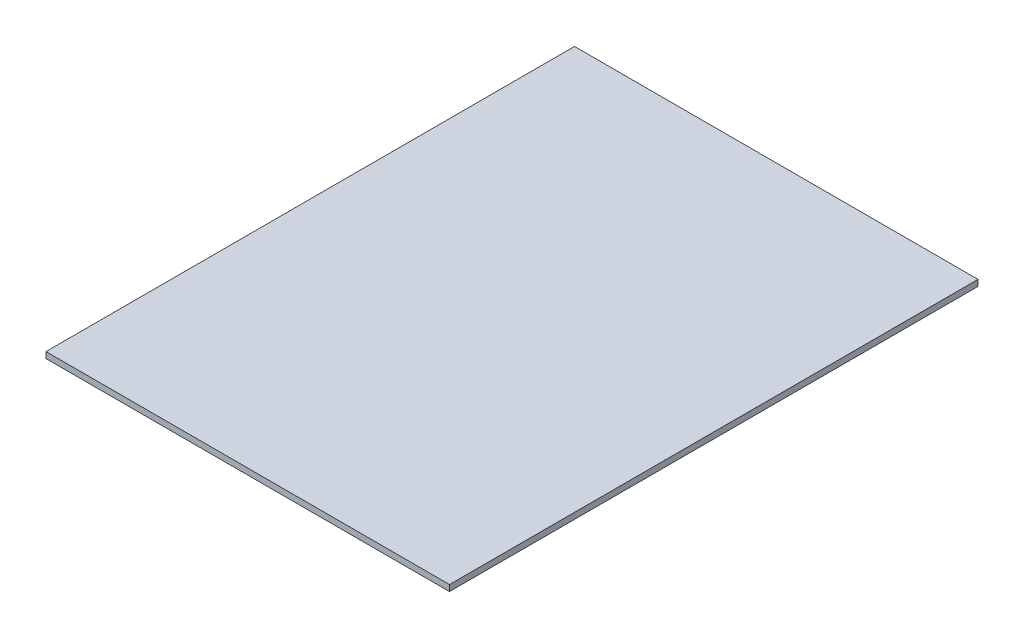
ISO-10303-21;
HEADER;
FILE_DESCRIPTION(('STEP AP214'),'2;1');
FILE_NAME('part.step','',(''),(''),'','','');
FILE_SCHEMA(('AUTOMOTIVE_DESIGN { 1 0 10303 214 1 1 1 1 }'));
ENDSEC;
DATA;
#1=APPLICATION_CONTEXT('core data for automotive mechanical design processes');
#2=APPLICATION_PROTOCOL_DEFINITION('international standard','automotive_design',2000,#1);
#3=PRODUCT_CONTEXT('',#1,'mechanical');
#4=PRODUCT('Part','Part','',(#3));
#5=PRODUCT_RELATED_PRODUCT_CATEGORY('part','',(#4));
#6=PRODUCT_DEFINITION_FORMATION('','',#4);
#7=PRODUCT_DEFINITION_CONTEXT('part definition',#1,'design');
#8=PRODUCT_DEFINITION('design','',#6,#7);
#9=PRODUCT_DEFINITION_SHAPE('','',#8);
#10=(LENGTH_UNIT() NAMED_UNIT(*) SI_UNIT(.MILLI.,.METRE.));
#11=(NAMED_UNIT(*) PLANE_ANGLE_UNIT() SI_UNIT($,.RADIAN.));
#12=(NAMED_UNIT(*) SI_UNIT($,.STERADIAN.) SOLID_ANGLE_UNIT());
#13=UNCERTAINTY_MEASURE_WITH_UNIT(LENGTH_MEASURE(1.E-05),#10,'distance_accuracy_value','');
#14=(GEOMETRIC_REPRESENTATION_CONTEXT(3) GLOBAL_UNCERTAINTY_ASSIGNED_CONTEXT((#13)) GLOBAL_UNIT_ASSIGNED_CONTEXT((#10,
#11,#12)) REPRESENTATION_CONTEXT('',''));
#15=CARTESIAN_POINT('',(0.,0.,0.));
#16=DIRECTION('',(0.,0.,1.));
#17=DIRECTION('',(1.,0.,0.));
#18=AXIS2_PLACEMENT_3D('',#15,#16,#17);
#19=CARTESIAN_POINT('',(-198.5,6.,260.));
#20=DIRECTION('',(1.,0.,0.));
#21=DIRECTION('',(0.,0.,-1.));
#22=AXIS2_PLACEMENT_3D('',#19,#20,#21);
#23=PLANE('',#22);
#24=DIRECTION('',(0.,0.,1.));
#25=VECTOR('',#24,1.);
#26=CARTESIAN_POINT('',(-198.5,0.,260.));
#27=LINE('',#26,#25);
#28=CARTESIAN_POINT('',(-198.5,0.,-260.));
#29=VERTEX_POINT('',#28);
#30=CARTESIAN_POINT('',(-198.5,0.,260.));
#31=VERTEX_POINT('',#30);
#32=EDGE_CURVE('E95',#29,#31,#27,.T.);
#33=ORIENTED_EDGE('',*,*,#32,.T.);
#34=DIRECTION('',(0.,-1.,0.));
#35=VECTOR('',#34,1.);
#36=CARTESIAN_POINT('',(-198.5,6.,260.));
#37=LINE('',#36,#35);
#38=CARTESIAN_POINT('',(-198.5,6.,260.));
#39=VERTEX_POINT('',#38);
#40=EDGE_CURVE('E11',#39,#31,#37,.T.);
#41=ORIENTED_EDGE('',*,*,#40,.F.);
#42=DIRECTION('',(0.,0.,1.));
#43=VECTOR('',#42,1.);
#44=CARTESIAN_POINT('',(-198.5,6.,260.));
#45=LINE('',#44,#43);
#46=CARTESIAN_POINT('',(-198.5,6.,-260.));
#47=VERTEX_POINT('',#46);
#48=EDGE_CURVE('E83',#47,#39,#45,.T.);
#49=ORIENTED_EDGE('',*,*,#48,.F.);
#50=DIRECTION('',(0.,-1.,0.));
#51=VECTOR('',#50,1.);
#52=CARTESIAN_POINT('',(-198.5,6.,-260.));
#53=LINE('',#52,#51);
#54=EDGE_CURVE('E91',#47,#29,#53,.T.);
#55=ORIENTED_EDGE('',*,*,#54,.T.);
#56=EDGE_LOOP('',(#33,#41,#49,#55));
#57=FACE_BOUND('',#56,.T.);
#58=ADVANCED_FACE('F32',(#57),#23,.F.);
#59=CARTESIAN_POINT('',(198.5,6.,260.));
#60=DIRECTION('',(0.,0.,-1.));
#61=DIRECTION('',(-1.,0.,0.));
#62=AXIS2_PLACEMENT_3D('',#59,#60,#61);
#63=PLANE('',#62);
#64=DIRECTION('',(1.,0.,0.));
#65=VECTOR('',#64,1.);
#66=CARTESIAN_POINT('',(198.5,0.,260.));
#67=LINE('',#66,#65);
#68=CARTESIAN_POINT('',(198.5,0.,260.));
#69=VERTEX_POINT('',#68);
#70=EDGE_CURVE('E87',#31,#69,#67,.T.);
#71=ORIENTED_EDGE('',*,*,#70,.T.);
#72=DIRECTION('',(0.,-1.,0.));
#73=VECTOR('',#72,1.);
#74=CARTESIAN_POINT('',(198.5,6.,260.));
#75=LINE('',#74,#73);
#76=CARTESIAN_POINT('',(198.5,6.,260.));
#77=VERTEX_POINT('',#76);
#78=EDGE_CURVE('E40',#77,#69,#75,.T.);
#79=ORIENTED_EDGE('',*,*,#78,.F.);
#80=DIRECTION('',(1.,0.,0.));
#81=VECTOR('',#80,1.);
#82=CARTESIAN_POINT('',(198.5,6.,260.));
#83=LINE('',#82,#81);
#84=EDGE_CURVE('E78',#39,#77,#83,.T.);
#85=ORIENTED_EDGE('',*,*,#84,.F.);
#86=ORIENTED_EDGE('',*,*,#40,.T.);
#87=EDGE_LOOP('',(#71,#79,#85,#86));
#88=FACE_BOUND('',#87,.T.);
#89=ADVANCED_FACE('F86',(#88),#63,.F.);
#90=CARTESIAN_POINT('',(198.5,6.,260.));
#91=DIRECTION('',(-1.,0.,0.));
#92=DIRECTION('',(0.,0.,1.));
#93=AXIS2_PLACEMENT_3D('',#90,#91,#92);
#94=PLANE('',#93);
#95=DIRECTION('',(0.,0.,-1.));
#96=VECTOR('',#95,1.);
#97=CARTESIAN_POINT('',(198.5,0.,260.));
#98=LINE('',#97,#96);
#99=CARTESIAN_POINT('',(198.5,0.,-260.));
#100=VERTEX_POINT('',#99);
#101=EDGE_CURVE('E65',#69,#100,#98,.T.);
#102=ORIENTED_EDGE('',*,*,#101,.T.);
#103=DIRECTION('',(0.,-1.,0.));
#104=VECTOR('',#103,1.);
#105=CARTESIAN_POINT('',(198.5,6.,-260.));
#106=LINE('',#105,#104);
#107=CARTESIAN_POINT('',(198.5,6.,-260.));
#108=VERTEX_POINT('',#107);
#109=EDGE_CURVE('E88',#108,#100,#106,.T.);
#110=ORIENTED_EDGE('',*,*,#109,.F.);
#111=DIRECTION('',(0.,0.,-1.));
#112=VECTOR('',#111,1.);
#113=CARTESIAN_POINT('',(198.5,6.,260.));
#114=LINE('',#113,#112);
#115=EDGE_CURVE('E81',#77,#108,#114,.T.);
#116=ORIENTED_EDGE('',*,*,#115,.F.);
#117=ORIENTED_EDGE('',*,*,#78,.T.);
#118=EDGE_LOOP('',(#102,#110,#116,#117));
#119=FACE_BOUND('',#118,.T.);
#120=ADVANCED_FACE('F89',(#119),#94,.F.);
#121=CARTESIAN_POINT('',(198.5,6.,-260.));
#122=DIRECTION('',(0.,0.,1.));
#123=DIRECTION('',(1.,0.,0.));
#124=AXIS2_PLACEMENT_3D('',#121,#122,#123);
#125=PLANE('',#124);
#126=DIRECTION('',(-1.,0.,0.));
#127=VECTOR('',#126,1.);
#128=CARTESIAN_POINT('',(198.5,0.,-260.));
#129=LINE('',#128,#127);
#130=EDGE_CURVE('E71',#100,#29,#129,.T.);
#131=ORIENTED_EDGE('',*,*,#130,.T.);
#132=ORIENTED_EDGE('',*,*,#54,.F.);
#133=DIRECTION('',(-1.,0.,0.));
#134=VECTOR('',#133,1.);
#135=CARTESIAN_POINT('',(198.5,6.,-260.));
#136=LINE('',#135,#134);
#137=EDGE_CURVE('E48',#108,#47,#136,.T.);
#138=ORIENTED_EDGE('',*,*,#137,.F.);
#139=ORIENTED_EDGE('',*,*,#109,.T.);
#140=EDGE_LOOP('',(#131,#132,#138,#139));
#141=FACE_BOUND('',#140,.T.);
#142=ADVANCED_FACE('F102',(#141),#125,.F.);
#143=CARTESIAN_POINT('',(0.,6.,0.));
#144=DIRECTION('',(0.,1.,0.));
#145=DIRECTION('',(0.,0.,1.));
#146=AXIS2_PLACEMENT_3D('',#143,#144,#145);
#147=PLANE('',#146);
#148=ORIENTED_EDGE('',*,*,#48,.T.);
#149=ORIENTED_EDGE('',*,*,#84,.T.);
#150=ORIENTED_EDGE('',*,*,#115,.T.);
#151=ORIENTED_EDGE('',*,*,#137,.T.);
#152=EDGE_LOOP('',(#148,#149,#150,#151));
#153=FACE_BOUND('',#152,.T.);
#154=ADVANCED_FACE('F79',(#153),#147,.T.);
#155=CARTESIAN_POINT('',(0.,0.,0.));
#156=DIRECTION('',(0.,1.,0.));
#157=DIRECTION('',(0.,0.,1.));
#158=AXIS2_PLACEMENT_3D('',#155,#156,#157);
#159=PLANE('',#158);
#160=ORIENTED_EDGE('',*,*,#32,.F.);
#161=ORIENTED_EDGE('',*,*,#130,.F.);
#162=ORIENTED_EDGE('',*,*,#101,.F.);
#163=ORIENTED_EDGE('',*,*,#70,.F.);
#164=EDGE_LOOP('',(#160,#161,#162,#163));
#165=FACE_BOUND('',#164,.T.);
#166=ADVANCED_FACE('F105',(#165),#159,.F.);
#167=CLOSED_SHELL('',(#58,#89,#120,#142,#154,#166));
#168=MANIFOLD_SOLID_BREP('B2',#167);
#169=ADVANCED_BREP_SHAPE_REPRESENTATION('',(#18,#168),#14);
#170=SHAPE_DEFINITION_REPRESENTATION(#9,#169);
ENDSEC;
END-ISO-10303-21;
